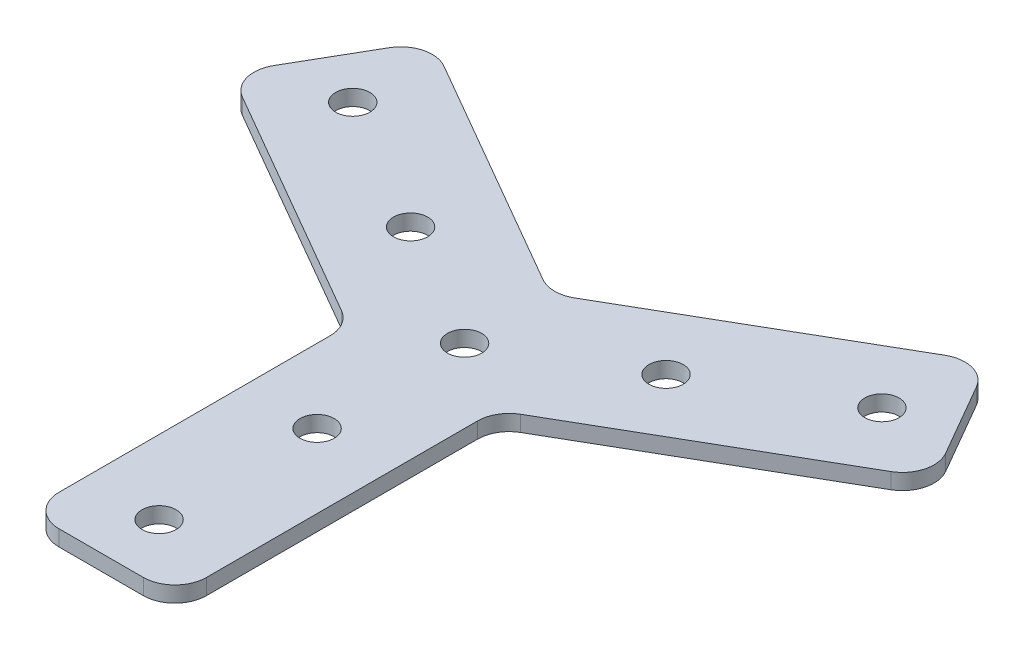
ISO-10303-21;
HEADER;
FILE_DESCRIPTION(('STEP AP214'),'2;1');
FILE_NAME('part.step','',(''),(''),'','','');
FILE_SCHEMA(('AUTOMOTIVE_DESIGN { 1 0 10303 214 1 1 1 1 }'));
ENDSEC;
DATA;
#1=APPLICATION_CONTEXT('core data for automotive mechanical design processes');
#2=APPLICATION_PROTOCOL_DEFINITION('international standard','automotive_design',2000,#1);
#3=PRODUCT_CONTEXT('',#1,'mechanical');
#4=PRODUCT('Part','Part','',(#3));
#5=PRODUCT_RELATED_PRODUCT_CATEGORY('part','',(#4));
#6=PRODUCT_DEFINITION_FORMATION('','',#4);
#7=PRODUCT_DEFINITION_CONTEXT('part definition',#1,'design');
#8=PRODUCT_DEFINITION('design','',#6,#7);
#9=PRODUCT_DEFINITION_SHAPE('','',#8);
#10=(LENGTH_UNIT() NAMED_UNIT(*) SI_UNIT(.MILLI.,.METRE.));
#11=(NAMED_UNIT(*) PLANE_ANGLE_UNIT() SI_UNIT($,.RADIAN.));
#12=(NAMED_UNIT(*) SI_UNIT($,.STERADIAN.) SOLID_ANGLE_UNIT());
#13=UNCERTAINTY_MEASURE_WITH_UNIT(LENGTH_MEASURE(1.E-05),#10,'distance_accuracy_value','');
#14=(GEOMETRIC_REPRESENTATION_CONTEXT(3) GLOBAL_UNCERTAINTY_ASSIGNED_CONTEXT((#13)) GLOBAL_UNIT_ASSIGNED_CONTEXT((#10,
#11,#12)) REPRESENTATION_CONTEXT('',''));
#15=CARTESIAN_POINT('',(0.,0.,0.));
#16=DIRECTION('',(0.,0.,1.));
#17=DIRECTION('',(1.,0.,0.));
#18=AXIS2_PLACEMENT_3D('',#15,#16,#17);
#19=CARTESIAN_POINT('',(-1.12860705479806,2.80807034313921,-7.07207801403957));
#20=DIRECTION('',(0.,-1.,0.));
#21=DIRECTION('',(0.,0.,-1.));
#22=AXIS2_PLACEMENT_3D('',#19,#20,#21);
#23=PLANE('',#22);
#24=CARTESIAN_POINT('',(10.9957485981869,2.80807034313921,-14.0720780140347));
#25=DIRECTION('',(0.,1.,0.));
#26=DIRECTION('',(0.,0.,1.));
#27=AXIS2_PLACEMENT_3D('',#24,#25,#26);
#28=CIRCLE('',#27,1.625);
#29=CARTESIAN_POINT('',(10.9957485981869,2.80807034313921,-12.4470780140347));
#30=VERTEX_POINT('',#29);
#31=EDGE_CURVE('E173',#30,#30,#28,.T.);
#32=ORIENTED_EDGE('',*,*,#31,.F.);
#33=EDGE_LOOP('',(#32));
#34=FACE_BOUND('',#33,.T.);
#35=CARTESIAN_POINT('',(23.9861296549535,2.80807034313921,-21.5720780140347));
#36=DIRECTION('',(0.,1.,0.));
#37=DIRECTION('',(0.,0.,1.));
#38=AXIS2_PLACEMENT_3D('',#35,#36,#37);
#39=CIRCLE('',#38,1.625);
#40=CARTESIAN_POINT('',(23.9861296549535,2.80807034313921,-19.9470780140347));
#41=VERTEX_POINT('',#40);
#42=EDGE_CURVE('E323',#41,#41,#39,.T.);
#43=ORIENTED_EDGE('',*,*,#42,.F.);
#44=EDGE_LOOP('',(#43));
#45=FACE_BOUND('',#44,.T.);
#46=CARTESIAN_POINT('',(-1.12860705480375,2.80807034313921,6.92792198596045));
#47=DIRECTION('',(0.,1.,0.));
#48=DIRECTION('',(-0.866025403784436,0.,-0.500000000000004));
#49=AXIS2_PLACEMENT_3D('',#46,#47,#48);
#50=CIRCLE('',#49,1.625);
#51=CARTESIAN_POINT('',(-2.53589833595346,2.80807034313921,6.11542198596044));
#52=VERTEX_POINT('',#51);
#53=EDGE_CURVE('E317',#52,#52,#50,.T.);
#54=ORIENTED_EDGE('',*,*,#53,.F.);
#55=EDGE_LOOP('',(#54));
#56=FACE_BOUND('',#55,.T.);
#57=CARTESIAN_POINT('',(-1.12860705480382,2.80807034313921,21.9279219859604));
#58=DIRECTION('',(0.,1.,0.));
#59=DIRECTION('',(-0.866025403784436,0.,-0.500000000000004));
#60=AXIS2_PLACEMENT_3D('',#57,#58,#59);
#61=CIRCLE('',#60,1.625);
#62=CARTESIAN_POINT('',(-2.53589833595353,2.80807034313921,21.1154219859604));
#63=VERTEX_POINT('',#62);
#64=EDGE_CURVE('E311',#63,#63,#61,.T.);
#65=ORIENTED_EDGE('',*,*,#64,.F.);
#66=EDGE_LOOP('',(#65));
#67=FACE_BOUND('',#66,.T.);
#68=CARTESIAN_POINT('',(-13.2529627077773,2.80807034313921,-14.0720780140446));
#69=DIRECTION('',(0.,1.,0.));
#70=DIRECTION('',(0.866025403784443,0.,-0.499999999999992));
#71=AXIS2_PLACEMENT_3D('',#68,#69,#70);
#72=CIRCLE('',#71,1.625);
#73=CARTESIAN_POINT('',(-11.8456714266276,2.80807034313921,-14.8845780140445));
#74=VERTEX_POINT('',#73);
#75=EDGE_CURVE('E305',#74,#74,#72,.T.);
#76=ORIENTED_EDGE('',*,*,#75,.F.);
#77=EDGE_LOOP('',(#76));
#78=FACE_BOUND('',#77,.T.);
#79=CARTESIAN_POINT('',(-26.2433437645438,2.80807034313921,-21.5720780140447));
#80=DIRECTION('',(0.,1.,0.));
#81=DIRECTION('',(0.866025403784443,0.,-0.499999999999992));
#82=AXIS2_PLACEMENT_3D('',#79,#80,#81);
#83=CIRCLE('',#82,1.625);
#84=CARTESIAN_POINT('',(-24.8360524833941,2.80807034313921,-22.3845780140447));
#85=VERTEX_POINT('',#84);
#86=EDGE_CURVE('E299',#85,#85,#83,.T.);
#87=ORIENTED_EDGE('',*,*,#86,.F.);
#88=EDGE_LOOP('',(#87));
#89=FACE_BOUND('',#88,.T.);
#90=CARTESIAN_POINT('',(-1.12860705479806,2.80807034313921,-7.07207801403957));
#91=DIRECTION('',(0.,1.,0.));
#92=DIRECTION('',(0.,0.,1.));
#93=AXIS2_PLACEMENT_3D('',#90,#91,#92);
#94=CIRCLE('',#93,1.625);
#95=CARTESIAN_POINT('',(-1.12860705479806,2.80807034313921,-5.44707801403957));
#96=VERTEX_POINT('',#95);
#97=EDGE_CURVE('E279',#96,#96,#94,.T.);
#98=ORIENTED_EDGE('',*,*,#97,.F.);
#99=EDGE_LOOP('',(#98));
#100=FACE_BOUND('',#99,.T.);
#101=DIRECTION('',(0.866025403784438,0.,-0.5));
#102=VECTOR('',#101,1.);
#103=CARTESIAN_POINT('',(5.87139294520211,2.80807034313921,-3.0306261297057));
#104=LINE('',#103,#102);
#105=CARTESIAN_POINT('',(7.37139294520178,2.80807034313921,-3.89665153348995));
#106=VERTEX_POINT('',#105);
#107=CARTESIAN_POINT('',(29.6511931644146,2.80807034313921,-16.7599001875436));
#108=VERTEX_POINT('',#107);
#109=EDGE_CURVE('E280',#106,#108,#104,.T.);
#110=ORIENTED_EDGE('',*,*,#109,.T.);
#111=CARTESIAN_POINT('',(28.1511931644146,2.80807034313921,-19.3579763988969));
#112=DIRECTION('',(0.,-1.,0.));
#113=DIRECTION('',(0.,0.,-1.));
#114=AXIS2_PLACEMENT_3D('',#111,#112,#113);
#115=CIRCLE('',#114,3.);
#116=CARTESIAN_POINT('',(30.7492693757679,2.80807034313921,-20.8579763988969));
#117=VERTEX_POINT('',#116);
#118=EDGE_CURVE('E187',#108,#117,#115,.F.);
#119=ORIENTED_EDGE('',*,*,#118,.T.);
#120=DIRECTION('',(-0.5,0.,-0.866025403784438));
#121=VECTOR('',#120,1.);
#122=CARTESIAN_POINT('',(32.2492693757679,2.80807034313921,-18.2599001875436));
#123=LINE('',#122,#121);
#124=CARTESIAN_POINT('',(26.7492693757679,2.80807034313921,-27.7861796291724));
#125=VERTEX_POINT('',#124);
#126=EDGE_CURVE('E282',#117,#125,#123,.T.);
#127=ORIENTED_EDGE('',*,*,#126,.T.);
#128=CARTESIAN_POINT('',(24.1511931644146,2.80807034313921,-26.2861796291725));
#129=DIRECTION('',(0.,-1.,0.));
#130=DIRECTION('',(0.,0.,-1.));
#131=AXIS2_PLACEMENT_3D('',#128,#129,#130);
#132=CIRCLE('',#131,3.);
#133=CARTESIAN_POINT('',(22.6511931644146,2.80807034313921,-28.8842558405258));
#134=VERTEX_POINT('',#133);
#135=EDGE_CURVE('E185',#125,#134,#132,.F.);
#136=ORIENTED_EDGE('',*,*,#135,.T.);
#137=DIRECTION('',(-0.866025403784438,0.,0.500000000000001));
#138=VECTOR('',#137,1.);
#139=CARTESIAN_POINT('',(25.2492693757679,2.80807034313921,-30.3842558405258));
#140=LINE('',#139,#138);
#141=CARTESIAN_POINT('',(0.371392945202446,2.80807034313921,-16.0210071864725));
#142=VERTEX_POINT('',#141);
#143=EDGE_CURVE('E285',#134,#142,#140,.T.);
#144=ORIENTED_EDGE('',*,*,#143,.T.);
#145=CARTESIAN_POINT('',(-1.12860705479756,2.80807034313921,-18.6190833978258));
#146=DIRECTION('',(0.,-1.,0.));
#147=DIRECTION('',(0.,0.,-1.));
#148=AXIS2_PLACEMENT_3D('',#145,#146,#147);
#149=CIRCLE('',#148,3.);
#150=CARTESIAN_POINT('',(-2.62860705479855,2.80807034313921,-16.0210071864731));
#151=VERTEX_POINT('',#150);
#152=EDGE_CURVE('E237',#142,#151,#149,.T.);
#153=ORIENTED_EDGE('',*,*,#152,.T.);
#154=DIRECTION('',(-0.866025403784248,0.,-0.500000000000331));
#155=VECTOR('',#154,1.);
#156=CARTESIAN_POINT('',(-1.12860705479821,2.80807034313921,-15.1549817826877));
#157=LINE('',#156,#155);
#158=CARTESIAN_POINT('',(-24.9084072740045,2.80807034313921,-28.8842558405341));
#159=VERTEX_POINT('',#158);
#160=EDGE_CURVE('E288',#151,#159,#157,.T.);
#161=ORIENTED_EDGE('',*,*,#160,.T.);
#162=CARTESIAN_POINT('',(-26.4084072740055,2.80807034313921,-26.2861796291814));
#163=DIRECTION('',(0.,-1.,0.));
#164=DIRECTION('',(0.,0.,-1.));
#165=AXIS2_PLACEMENT_3D('',#162,#163,#164);
#166=CIRCLE('',#165,3.);
#167=CARTESIAN_POINT('',(-29.0064834853588,2.80807034313921,-27.7861796291814));
#168=VERTEX_POINT('',#167);
#169=EDGE_CURVE('E183',#159,#168,#166,.F.);
#170=ORIENTED_EDGE('',*,*,#169,.T.);
#171=DIRECTION('',(-0.500000000000008,0.,0.866025403784434));
#172=VECTOR('',#171,1.);
#173=CARTESIAN_POINT('',(-27.5064834853582,2.80807034313921,-30.3842558405357));
#174=LINE('',#173,#172);
#175=CARTESIAN_POINT('',(-33.0064834853586,2.80807034313921,-20.8579763989064));
#176=VERTEX_POINT('',#175);
#177=EDGE_CURVE('E291',#168,#176,#174,.T.);
#178=ORIENTED_EDGE('',*,*,#177,.T.);
#179=CARTESIAN_POINT('',(-30.4084072740053,2.80807034313921,-19.3579763989064));
#180=DIRECTION('',(0.,-1.,0.));
#181=DIRECTION('',(0.,0.,-1.));
#182=AXIS2_PLACEMENT_3D('',#179,#180,#181);
#183=CIRCLE('',#182,3.);
#184=CARTESIAN_POINT('',(-31.9084072740058,2.80807034313921,-16.7599001875534));
#185=VERTEX_POINT('',#184);
#186=EDGE_CURVE('E153',#176,#185,#183,.F.);
#187=ORIENTED_EDGE('',*,*,#186,.T.);
#188=DIRECTION('',(0.86602540378434,0.,0.500000000000171));
#189=VECTOR('',#188,1.);
#190=CARTESIAN_POINT('',(-34.5064834853583,2.80807034313921,-18.2599001875536));
#191=LINE('',#190,#189);
#192=CARTESIAN_POINT('',(-9.62860705480327,2.80807034313921,-3.89665153349986));
#193=VERTEX_POINT('',#192);
#194=EDGE_CURVE('E244',#185,#193,#191,.T.);
#195=ORIENTED_EDGE('',*,*,#194,.T.);
#196=CARTESIAN_POINT('',(-11.1286070548038,2.80807034313921,-1.29857532214684));
#197=DIRECTION('',(0.,-1.,0.));
#198=DIRECTION('',(0.,0.,-1.));
#199=AXIS2_PLACEMENT_3D('',#196,#197,#198);
#200=CIRCLE('',#199,3.);
#201=CARTESIAN_POINT('',(-8.12860705480379,2.80807034313921,-1.29857532214682));
#202=VERTEX_POINT('',#201);
#203=EDGE_CURVE('E24',#193,#202,#200,.T.);
#204=ORIENTED_EDGE('',*,*,#203,.T.);
#205=DIRECTION('',(0.,0.,1.));
#206=VECTOR('',#205,1.);
#207=CARTESIAN_POINT('',(-8.12860705480378,2.80807034313921,-3.03062612971531));
#208=LINE('',#207,#206);
#209=CARTESIAN_POINT('',(-8.12860705480389,2.80807034313921,24.4279219859604));
#210=VERTEX_POINT('',#209);
#211=EDGE_CURVE('E242',#202,#210,#208,.T.);
#212=ORIENTED_EDGE('',*,*,#211,.T.);
#213=CARTESIAN_POINT('',(-5.12860705480389,2.80807034313921,24.4279219859604));
#214=DIRECTION('',(0.,-1.,0.));
#215=DIRECTION('',(0.,0.,-1.));
#216=AXIS2_PLACEMENT_3D('',#213,#214,#215);
#217=CIRCLE('',#216,3.);
#218=CARTESIAN_POINT('',(-5.12860705480391,2.80807034313921,27.4279219859604));
#219=VERTEX_POINT('',#218);
#220=EDGE_CURVE('E152',#210,#219,#217,.F.);
#221=ORIENTED_EDGE('',*,*,#220,.T.);
#222=DIRECTION('',(1.,0.,0.));
#223=VECTOR('',#222,1.);
#224=CARTESIAN_POINT('',(-8.12860705480391,2.80807034313921,27.4279219859604));
#225=LINE('',#224,#223);
#226=CARTESIAN_POINT('',(2.8713929451968,2.80807034313921,27.4279219859605));
#227=VERTEX_POINT('',#226);
#228=EDGE_CURVE('E147',#219,#227,#225,.T.);
#229=ORIENTED_EDGE('',*,*,#228,.T.);
#230=CARTESIAN_POINT('',(2.87139294519682,2.80807034313921,24.4279219859605));
#231=DIRECTION('',(0.,-1.,0.));
#232=DIRECTION('',(0.,0.,-1.));
#233=AXIS2_PLACEMENT_3D('',#230,#231,#232);
#234=CIRCLE('',#233,3.);
#235=CARTESIAN_POINT('',(5.87139294519682,2.80807034313921,24.427921985961));
#236=VERTEX_POINT('',#235);
#237=EDGE_CURVE('E142',#227,#236,#234,.F.);
#238=ORIENTED_EDGE('',*,*,#237,.T.);
#239=DIRECTION('',(1.92816358337802E-13,0.,-1.));
#240=VECTOR('',#239,1.);
#241=CARTESIAN_POINT('',(5.87139294519624,2.80807034313921,27.4279219859605));
#242=LINE('',#241,#240);
#243=CARTESIAN_POINT('',(5.87139294520178,2.80807034313921,-1.29857532213721));
#244=VERTEX_POINT('',#243);
#245=EDGE_CURVE('E145',#236,#244,#242,.T.);
#246=ORIENTED_EDGE('',*,*,#245,.T.);
#247=CARTESIAN_POINT('',(8.87139294520178,2.80807034313921,-1.29857532213663));
#248=DIRECTION('',(0.,-1.,0.));
#249=DIRECTION('',(0.,0.,-1.));
#250=AXIS2_PLACEMENT_3D('',#247,#248,#249);
#251=CIRCLE('',#250,3.);
#252=EDGE_CURVE('E233',#244,#106,#251,.T.);
#253=ORIENTED_EDGE('',*,*,#252,.T.);
#254=EDGE_LOOP('',(#110,#119,#127,#136,#144,#153,#161,#170,#178,#187,#195,#204,#212,#221,#229,
#238,#246,#253));
#255=FACE_BOUND('',#254,.T.);
#256=ADVANCED_FACE('F16',(#34,#45,#56,#67,#78,#89,#100,#255),#23,.F.);
#257=CARTESIAN_POINT('',(-1.12860705479806,1.30807034313921,-7.07207801403957));
#258=DIRECTION('',(0.,-1.,0.));
#259=DIRECTION('',(0.,0.,-1.));
#260=AXIS2_PLACEMENT_3D('',#257,#258,#259);
#261=PLANE('',#260);
#262=CARTESIAN_POINT('',(10.9957485981869,1.30807034313921,-14.0720780140347));
#263=DIRECTION('',(0.,1.,0.));
#264=DIRECTION('',(0.,0.,1.));
#265=AXIS2_PLACEMENT_3D('',#262,#263,#264);
#266=CIRCLE('',#265,1.625);
#267=CARTESIAN_POINT('',(10.9957485981869,1.30807034313921,-12.4470780140347));
#268=VERTEX_POINT('',#267);
#269=EDGE_CURVE('E168',#268,#268,#266,.T.);
#270=ORIENTED_EDGE('',*,*,#269,.T.);
#271=EDGE_LOOP('',(#270));
#272=FACE_BOUND('',#271,.T.);
#273=CARTESIAN_POINT('',(23.9861296549535,1.30807034313921,-21.5720780140347));
#274=DIRECTION('',(0.,1.,0.));
#275=DIRECTION('',(0.,0.,1.));
#276=AXIS2_PLACEMENT_3D('',#273,#274,#275);
#277=CIRCLE('',#276,1.625);
#278=CARTESIAN_POINT('',(23.9861296549535,1.30807034313921,-19.9470780140347));
#279=VERTEX_POINT('',#278);
#280=EDGE_CURVE('E326',#279,#279,#277,.T.);
#281=ORIENTED_EDGE('',*,*,#280,.T.);
#282=EDGE_LOOP('',(#281));
#283=FACE_BOUND('',#282,.T.);
#284=CARTESIAN_POINT('',(-1.12860705480375,1.30807034313921,6.92792198596045));
#285=DIRECTION('',(0.,1.,0.));
#286=DIRECTION('',(-0.866025403784436,0.,-0.500000000000004));
#287=AXIS2_PLACEMENT_3D('',#284,#285,#286);
#288=CIRCLE('',#287,1.625);
#289=CARTESIAN_POINT('',(-2.53589833595346,1.30807034313921,6.11542198596044));
#290=VERTEX_POINT('',#289);
#291=EDGE_CURVE('E320',#290,#290,#288,.T.);
#292=ORIENTED_EDGE('',*,*,#291,.T.);
#293=EDGE_LOOP('',(#292));
#294=FACE_BOUND('',#293,.T.);
#295=CARTESIAN_POINT('',(-1.12860705480382,1.30807034313921,21.9279219859604));
#296=DIRECTION('',(0.,1.,0.));
#297=DIRECTION('',(-0.866025403784436,0.,-0.500000000000004));
#298=AXIS2_PLACEMENT_3D('',#295,#296,#297);
#299=CIRCLE('',#298,1.625);
#300=CARTESIAN_POINT('',(-2.53589833595353,1.30807034313921,21.1154219859604));
#301=VERTEX_POINT('',#300);
#302=EDGE_CURVE('E314',#301,#301,#299,.T.);
#303=ORIENTED_EDGE('',*,*,#302,.T.);
#304=EDGE_LOOP('',(#303));
#305=FACE_BOUND('',#304,.T.);
#306=CARTESIAN_POINT('',(-13.2529627077773,1.30807034313921,-14.0720780140446));
#307=DIRECTION('',(0.,1.,0.));
#308=DIRECTION('',(0.866025403784443,0.,-0.499999999999992));
#309=AXIS2_PLACEMENT_3D('',#306,#307,#308);
#310=CIRCLE('',#309,1.625);
#311=CARTESIAN_POINT('',(-11.8456714266276,1.30807034313921,-14.8845780140445));
#312=VERTEX_POINT('',#311);
#313=EDGE_CURVE('E308',#312,#312,#310,.T.);
#314=ORIENTED_EDGE('',*,*,#313,.T.);
#315=EDGE_LOOP('',(#314));
#316=FACE_BOUND('',#315,.T.);
#317=CARTESIAN_POINT('',(-26.2433437645438,1.30807034313921,-21.5720780140447));
#318=DIRECTION('',(0.,1.,0.));
#319=DIRECTION('',(0.866025403784443,0.,-0.499999999999992));
#320=AXIS2_PLACEMENT_3D('',#317,#318,#319);
#321=CIRCLE('',#320,1.625);
#322=CARTESIAN_POINT('',(-24.8360524833941,1.30807034313921,-22.3845780140447));
#323=VERTEX_POINT('',#322);
#324=EDGE_CURVE('E302',#323,#323,#321,.T.);
#325=ORIENTED_EDGE('',*,*,#324,.T.);
#326=EDGE_LOOP('',(#325));
#327=FACE_BOUND('',#326,.T.);
#328=CARTESIAN_POINT('',(-1.12860705479806,1.30807034313921,-7.07207801403957));
#329=DIRECTION('',(0.,1.,0.));
#330=DIRECTION('',(0.,0.,1.));
#331=AXIS2_PLACEMENT_3D('',#328,#329,#330);
#332=CIRCLE('',#331,1.625);
#333=CARTESIAN_POINT('',(-1.12860705479806,1.30807034313921,-5.44707801403957));
#334=VERTEX_POINT('',#333);
#335=EDGE_CURVE('E296',#334,#334,#332,.T.);
#336=ORIENTED_EDGE('',*,*,#335,.T.);
#337=EDGE_LOOP('',(#336));
#338=FACE_BOUND('',#337,.T.);
#339=DIRECTION('',(-0.5,0.,-0.866025403784438));
#340=VECTOR('',#339,1.);
#341=CARTESIAN_POINT('',(32.2492693757679,1.30807034313921,-18.2599001875436));
#342=LINE('',#341,#340);
#343=CARTESIAN_POINT('',(30.7492693757679,1.30807034313921,-20.8579763988969));
#344=VERTEX_POINT('',#343);
#345=CARTESIAN_POINT('',(26.7492693757679,1.30807034313921,-27.7861796291724));
#346=VERTEX_POINT('',#345);
#347=EDGE_CURVE('E435',#344,#346,#342,.T.);
#348=ORIENTED_EDGE('',*,*,#347,.F.);
#349=CARTESIAN_POINT('',(28.1511931644146,1.30807034313921,-19.3579763988969));
#350=DIRECTION('',(0.,-1.,0.));
#351=DIRECTION('',(0.,0.,-1.));
#352=AXIS2_PLACEMENT_3D('',#349,#350,#351);
#353=CIRCLE('',#352,3.);
#354=CARTESIAN_POINT('',(29.6511931644146,1.30807034313921,-16.7599001875436));
#355=VERTEX_POINT('',#354);
#356=EDGE_CURVE('E203',#344,#355,#353,.T.);
#357=ORIENTED_EDGE('',*,*,#356,.T.);
#358=DIRECTION('',(0.866025403784438,0.,-0.5));
#359=VECTOR('',#358,1.);
#360=CARTESIAN_POINT('',(5.87139294520211,1.30807034313921,-3.0306261297057));
#361=LINE('',#360,#359);
#362=CARTESIAN_POINT('',(7.37139294520178,1.30807034313921,-3.89665153348995));
#363=VERTEX_POINT('',#362);
#364=EDGE_CURVE('E163',#363,#355,#361,.T.);
#365=ORIENTED_EDGE('',*,*,#364,.F.);
#366=CARTESIAN_POINT('',(8.87139294520178,1.30807034313921,-1.29857532213663));
#367=DIRECTION('',(0.,-1.,0.));
#368=DIRECTION('',(0.,0.,-1.));
#369=AXIS2_PLACEMENT_3D('',#366,#367,#368);
#370=CIRCLE('',#369,3.);
#371=CARTESIAN_POINT('',(5.87139294520178,1.30807034313921,-1.29857532213721));
#372=VERTEX_POINT('',#371);
#373=EDGE_CURVE('E235',#363,#372,#370,.F.);
#374=ORIENTED_EDGE('',*,*,#373,.T.);
#375=DIRECTION('',(1.92816358337802E-13,0.,-1.));
#376=VECTOR('',#375,1.);
#377=CARTESIAN_POINT('',(5.87139294519624,1.30807034313921,27.4279219859605));
#378=LINE('',#377,#376);
#379=CARTESIAN_POINT('',(5.87139294519682,1.30807034313921,24.427921985961));
#380=VERTEX_POINT('',#379);
#381=EDGE_CURVE('E277',#380,#372,#378,.T.);
#382=ORIENTED_EDGE('',*,*,#381,.F.);
#383=CARTESIAN_POINT('',(2.87139294519682,1.30807034313921,24.4279219859605));
#384=DIRECTION('',(0.,-1.,0.));
#385=DIRECTION('',(0.,0.,-1.));
#386=AXIS2_PLACEMENT_3D('',#383,#384,#385);
#387=CIRCLE('',#386,3.);
#388=CARTESIAN_POINT('',(2.8713929451968,1.30807034313921,27.4279219859605));
#389=VERTEX_POINT('',#388);
#390=EDGE_CURVE('E167',#380,#389,#387,.T.);
#391=ORIENTED_EDGE('',*,*,#390,.T.);
#392=DIRECTION('',(1.,0.,0.));
#393=VECTOR('',#392,1.);
#394=CARTESIAN_POINT('',(-8.12860705480391,1.30807034313921,27.4279219859604));
#395=LINE('',#394,#393);
#396=CARTESIAN_POINT('',(-5.12860705480391,1.30807034313921,27.4279219859604));
#397=VERTEX_POINT('',#396);
#398=EDGE_CURVE('E268',#397,#389,#395,.T.);
#399=ORIENTED_EDGE('',*,*,#398,.F.);
#400=CARTESIAN_POINT('',(-5.12860705480389,1.30807034313921,24.4279219859604));
#401=DIRECTION('',(0.,-1.,0.));
#402=DIRECTION('',(0.,0.,-1.));
#403=AXIS2_PLACEMENT_3D('',#400,#401,#402);
#404=CIRCLE('',#403,3.);
#405=CARTESIAN_POINT('',(-8.12860705480389,1.30807034313921,24.4279219859604));
#406=VERTEX_POINT('',#405);
#407=EDGE_CURVE('E197',#397,#406,#404,.T.);
#408=ORIENTED_EDGE('',*,*,#407,.T.);
#409=DIRECTION('',(0.,0.,1.));
#410=VECTOR('',#409,1.);
#411=CARTESIAN_POINT('',(-8.12860705480378,1.30807034313921,-3.03062612971531));
#412=LINE('',#411,#410);
#413=CARTESIAN_POINT('',(-8.12860705480379,1.30807034313921,-1.29857532214682));
#414=VERTEX_POINT('',#413);
#415=EDGE_CURVE('E262',#414,#406,#412,.T.);
#416=ORIENTED_EDGE('',*,*,#415,.F.);
#417=CARTESIAN_POINT('',(-11.1286070548038,1.30807034313921,-1.29857532214684));
#418=DIRECTION('',(0.,-1.,0.));
#419=DIRECTION('',(0.,0.,-1.));
#420=AXIS2_PLACEMENT_3D('',#417,#418,#419);
#421=CIRCLE('',#420,3.);
#422=CARTESIAN_POINT('',(-9.62860705480327,1.30807034313921,-3.89665153349986));
#423=VERTEX_POINT('',#422);
#424=EDGE_CURVE('E10',#414,#423,#421,.F.);
#425=ORIENTED_EDGE('',*,*,#424,.T.);
#426=DIRECTION('',(0.86602540378434,0.,0.500000000000171));
#427=VECTOR('',#426,1.);
#428=CARTESIAN_POINT('',(-34.5064834853583,1.30807034313921,-18.2599001875536));
#429=LINE('',#428,#427);
#430=CARTESIAN_POINT('',(-31.9084072740058,1.30807034313921,-16.7599001875534));
#431=VERTEX_POINT('',#430);
#432=EDGE_CURVE('E260',#431,#423,#429,.T.);
#433=ORIENTED_EDGE('',*,*,#432,.F.);
#434=CARTESIAN_POINT('',(-30.4084072740053,1.30807034313921,-19.3579763989064));
#435=DIRECTION('',(0.,-1.,0.));
#436=DIRECTION('',(0.,0.,-1.));
#437=AXIS2_PLACEMENT_3D('',#434,#435,#436);
#438=CIRCLE('',#437,3.);
#439=CARTESIAN_POINT('',(-33.0064834853586,1.30807034313921,-20.8579763989064));
#440=VERTEX_POINT('',#439);
#441=EDGE_CURVE('E194',#431,#440,#438,.T.);
#442=ORIENTED_EDGE('',*,*,#441,.T.);
#443=DIRECTION('',(-0.500000000000008,0.,0.866025403784434));
#444=VECTOR('',#443,1.);
#445=CARTESIAN_POINT('',(-27.5064834853582,1.30807034313921,-30.3842558405357));
#446=LINE('',#445,#444);
#447=CARTESIAN_POINT('',(-29.0064834853588,1.30807034313921,-27.7861796291814));
#448=VERTEX_POINT('',#447);
#449=EDGE_CURVE('E266',#448,#440,#446,.T.);
#450=ORIENTED_EDGE('',*,*,#449,.F.);
#451=CARTESIAN_POINT('',(-26.4084072740055,1.30807034313921,-26.2861796291814));
#452=DIRECTION('',(0.,-1.,0.));
#453=DIRECTION('',(0.,0.,-1.));
#454=AXIS2_PLACEMENT_3D('',#451,#452,#453);
#455=CIRCLE('',#454,3.);
#456=CARTESIAN_POINT('',(-24.9084072740045,1.30807034313921,-28.8842558405341));
#457=VERTEX_POINT('',#456);
#458=EDGE_CURVE('E199',#448,#457,#455,.T.);
#459=ORIENTED_EDGE('',*,*,#458,.T.);
#460=DIRECTION('',(-0.866025403784248,0.,-0.500000000000331));
#461=VECTOR('',#460,1.);
#462=CARTESIAN_POINT('',(-1.12860705479821,1.30807034313921,-15.1549817826877));
#463=LINE('',#462,#461);
#464=CARTESIAN_POINT('',(-2.62860705479855,1.30807034313921,-16.0210071864731));
#465=VERTEX_POINT('',#464);
#466=EDGE_CURVE('E271',#465,#457,#463,.T.);
#467=ORIENTED_EDGE('',*,*,#466,.F.);
#468=CARTESIAN_POINT('',(-1.12860705479756,1.30807034313921,-18.6190833978258));
#469=DIRECTION('',(0.,-1.,0.));
#470=DIRECTION('',(0.,0.,-1.));
#471=AXIS2_PLACEMENT_3D('',#468,#469,#470);
#472=CIRCLE('',#471,3.);
#473=CARTESIAN_POINT('',(0.371392945202446,1.30807034313921,-16.0210071864725));
#474=VERTEX_POINT('',#473);
#475=EDGE_CURVE('E31',#465,#474,#472,.F.);
#476=ORIENTED_EDGE('',*,*,#475,.T.);
#477=DIRECTION('',(-0.866025403784438,0.,0.500000000000001));
#478=VECTOR('',#477,1.);
#479=CARTESIAN_POINT('',(25.2492693757679,1.30807034313921,-30.3842558405258));
#480=LINE('',#479,#478);
#481=CARTESIAN_POINT('',(22.6511931644146,1.30807034313921,-28.8842558405258));
#482=VERTEX_POINT('',#481);
#483=EDGE_CURVE('E434',#482,#474,#480,.T.);
#484=ORIENTED_EDGE('',*,*,#483,.F.);
#485=CARTESIAN_POINT('',(24.1511931644146,1.30807034313921,-26.2861796291725));
#486=DIRECTION('',(0.,-1.,0.));
#487=DIRECTION('',(0.,0.,-1.));
#488=AXIS2_PLACEMENT_3D('',#485,#486,#487);
#489=CIRCLE('',#488,3.);
#490=EDGE_CURVE('E201',#482,#346,#489,.T.);
#491=ORIENTED_EDGE('',*,*,#490,.T.);
#492=EDGE_LOOP('',(#348,#357,#365,#374,#382,#391,#399,#408,#416,#425,#433,#442,#450,#459,#467,
#476,#484,#491));
#493=FACE_BOUND('',#492,.T.);
#494=ADVANCED_FACE('F259',(#272,#283,#294,#305,#316,#327,#338,#493),#261,.T.);
#495=CARTESIAN_POINT('',(10.9957485981869,1.30807034313921,-14.0720780140347));
#496=DIRECTION('',(0.,1.,0.));
#497=DIRECTION('',(0.,0.,1.));
#498=AXIS2_PLACEMENT_3D('',#495,#496,#497);
#499=CYLINDRICAL_SURFACE('',#498,1.625);
#500=ORIENTED_EDGE('',*,*,#269,.F.);
#501=EDGE_LOOP('',(#500));
#502=FACE_BOUND('',#501,.T.);
#503=ORIENTED_EDGE('',*,*,#31,.T.);
#504=EDGE_LOOP('',(#503));
#505=FACE_BOUND('',#504,.T.);
#506=ADVANCED_FACE('F380',(#502,#505),#499,.F.);
#507=CARTESIAN_POINT('',(23.9861296549535,1.30807034313921,-21.5720780140347));
#508=DIRECTION('',(0.,1.,0.));
#509=DIRECTION('',(0.,0.,1.));
#510=AXIS2_PLACEMENT_3D('',#507,#508,#509);
#511=CYLINDRICAL_SURFACE('',#510,1.625);
#512=ORIENTED_EDGE('',*,*,#280,.F.);
#513=EDGE_LOOP('',(#512));
#514=FACE_BOUND('',#513,.T.);
#515=ORIENTED_EDGE('',*,*,#42,.T.);
#516=EDGE_LOOP('',(#515));
#517=FACE_BOUND('',#516,.T.);
#518=ADVANCED_FACE('F332',(#514,#517),#511,.F.);
#519=CARTESIAN_POINT('',(-1.12860705480375,1.30807034313921,6.92792198596045));
#520=DIRECTION('',(0.,1.,0.));
#521=DIRECTION('',(0.,0.,1.));
#522=AXIS2_PLACEMENT_3D('',#519,#520,#521);
#523=CYLINDRICAL_SURFACE('',#522,1.625);
#524=ORIENTED_EDGE('',*,*,#291,.F.);
#525=EDGE_LOOP('',(#524));
#526=FACE_BOUND('',#525,.T.);
#527=ORIENTED_EDGE('',*,*,#53,.T.);
#528=EDGE_LOOP('',(#527));
#529=FACE_BOUND('',#528,.T.);
#530=ADVANCED_FACE('F373',(#526,#529),#523,.F.);
#531=CARTESIAN_POINT('',(-1.12860705480382,1.30807034313921,21.9279219859604));
#532=DIRECTION('',(0.,1.,0.));
#533=DIRECTION('',(0.,0.,1.));
#534=AXIS2_PLACEMENT_3D('',#531,#532,#533);
#535=CYLINDRICAL_SURFACE('',#534,1.625);
#536=ORIENTED_EDGE('',*,*,#302,.F.);
#537=EDGE_LOOP('',(#536));
#538=FACE_BOUND('',#537,.T.);
#539=ORIENTED_EDGE('',*,*,#64,.T.);
#540=EDGE_LOOP('',(#539));
#541=FACE_BOUND('',#540,.T.);
#542=ADVANCED_FACE('F369',(#538,#541),#535,.F.);
#543=CARTESIAN_POINT('',(-13.2529627077773,1.30807034313921,-14.0720780140446));
#544=DIRECTION('',(0.,1.,0.));
#545=DIRECTION('',(0.,0.,1.));
#546=AXIS2_PLACEMENT_3D('',#543,#544,#545);
#547=CYLINDRICAL_SURFACE('',#546,1.625);
#548=ORIENTED_EDGE('',*,*,#313,.F.);
#549=EDGE_LOOP('',(#548));
#550=FACE_BOUND('',#549,.T.);
#551=ORIENTED_EDGE('',*,*,#75,.T.);
#552=EDGE_LOOP('',(#551));
#553=FACE_BOUND('',#552,.T.);
#554=ADVANCED_FACE('F361',(#550,#553),#547,.F.);
#555=CARTESIAN_POINT('',(-26.2433437645438,1.30807034313921,-21.5720780140447));
#556=DIRECTION('',(0.,1.,0.));
#557=DIRECTION('',(0.,0.,1.));
#558=AXIS2_PLACEMENT_3D('',#555,#556,#557);
#559=CYLINDRICAL_SURFACE('',#558,1.625);
#560=ORIENTED_EDGE('',*,*,#324,.F.);
#561=EDGE_LOOP('',(#560));
#562=FACE_BOUND('',#561,.T.);
#563=ORIENTED_EDGE('',*,*,#86,.T.);
#564=EDGE_LOOP('',(#563));
#565=FACE_BOUND('',#564,.T.);
#566=ADVANCED_FACE('F351',(#562,#565),#559,.F.);
#567=CARTESIAN_POINT('',(-1.12860705479806,1.30807034313921,-7.07207801403957));
#568=DIRECTION('',(0.,1.,0.));
#569=DIRECTION('',(0.,0.,1.));
#570=AXIS2_PLACEMENT_3D('',#567,#568,#569);
#571=CYLINDRICAL_SURFACE('',#570,1.625);
#572=ORIENTED_EDGE('',*,*,#335,.F.);
#573=EDGE_LOOP('',(#572));
#574=FACE_BOUND('',#573,.T.);
#575=ORIENTED_EDGE('',*,*,#97,.T.);
#576=EDGE_LOOP('',(#575));
#577=FACE_BOUND('',#576,.T.);
#578=ADVANCED_FACE('F348',(#574,#577),#571,.F.);
#579=CARTESIAN_POINT('',(5.87139294520211,1.30807034313921,-3.0306261297057));
#580=DIRECTION('',(0.500000000000001,0.,0.866025403784438));
#581=DIRECTION('',(0.866025403784438,0.,-0.500000000000001));
#582=AXIS2_PLACEMENT_3D('',#579,#580,#581);
#583=PLANE('',#582);
#584=ORIENTED_EDGE('',*,*,#109,.F.);
#585=DIRECTION('',(0.,1.,0.));
#586=VECTOR('',#585,1.);
#587=CARTESIAN_POINT('',(7.37139294520178,1.30807034313921,-3.89665153348995));
#588=LINE('',#587,#586);
#589=EDGE_CURVE('E179',#106,#363,#588,.F.);
#590=ORIENTED_EDGE('',*,*,#589,.T.);
#591=ORIENTED_EDGE('',*,*,#364,.T.);
#592=DIRECTION('',(0.,1.,0.));
#593=VECTOR('',#592,1.);
#594=CARTESIAN_POINT('',(29.6511931644146,1.30807034313921,-16.7599001875436));
#595=LINE('',#594,#593);
#596=EDGE_CURVE('E170',#355,#108,#595,.T.);
#597=ORIENTED_EDGE('',*,*,#596,.T.);
#598=EDGE_LOOP('',(#584,#590,#591,#597));
#599=FACE_BOUND('',#598,.T.);
#600=ADVANCED_FACE('F350',(#599),#583,.T.);
#601=CARTESIAN_POINT('',(5.87139294519624,1.30807034313921,27.4279219859605));
#602=DIRECTION('',(1.,0.,1.92816358337802E-13));
#603=DIRECTION('',(1.92816358337802E-13,0.,-1.));
#604=AXIS2_PLACEMENT_3D('',#601,#602,#603);
#605=PLANE('',#604);
#606=ORIENTED_EDGE('',*,*,#381,.T.);
#607=DIRECTION('',(0.,1.,0.));
#608=VECTOR('',#607,1.);
#609=CARTESIAN_POINT('',(5.87139294520178,2.80807034313921,-1.29857532213721));
#610=LINE('',#609,#608);
#611=EDGE_CURVE('E162',#372,#244,#610,.T.);
#612=ORIENTED_EDGE('',*,*,#611,.T.);
#613=ORIENTED_EDGE('',*,*,#245,.F.);
#614=DIRECTION('',(0.,1.,0.));
#615=VECTOR('',#614,1.);
#616=CARTESIAN_POINT('',(5.87139294519682,1.30807034313921,24.427921985961));
#617=LINE('',#616,#615);
#618=EDGE_CURVE('E159',#236,#380,#617,.F.);
#619=ORIENTED_EDGE('',*,*,#618,.T.);
#620=EDGE_LOOP('',(#606,#612,#613,#619));
#621=FACE_BOUND('',#620,.T.);
#622=ADVANCED_FACE('F158',(#621),#605,.T.);
#623=CARTESIAN_POINT('',(-8.12860705480391,1.30807034313921,27.4279219859604));
#624=DIRECTION('',(0.,0.,1.));
#625=DIRECTION('',(1.,0.,0.));
#626=AXIS2_PLACEMENT_3D('',#623,#624,#625);
#627=PLANE('',#626);
#628=ORIENTED_EDGE('',*,*,#228,.F.);
#629=DIRECTION('',(0.,1.,0.));
#630=VECTOR('',#629,1.);
#631=CARTESIAN_POINT('',(-5.12860705480391,1.30807034313921,27.4279219859604));
#632=LINE('',#631,#630);
#633=EDGE_CURVE('E231',#219,#397,#632,.F.);
#634=ORIENTED_EDGE('',*,*,#633,.T.);
#635=ORIENTED_EDGE('',*,*,#398,.T.);
#636=DIRECTION('',(0.,1.,0.));
#637=VECTOR('',#636,1.);
#638=CARTESIAN_POINT('',(2.8713929451968,1.30807034313921,27.4279219859605));
#639=LINE('',#638,#637);
#640=EDGE_CURVE('E229',#389,#227,#639,.T.);
#641=ORIENTED_EDGE('',*,*,#640,.T.);
#642=EDGE_LOOP('',(#628,#634,#635,#641));
#643=FACE_BOUND('',#642,.T.);
#644=ADVANCED_FACE('F468',(#643),#627,.T.);
#645=CARTESIAN_POINT('',(-8.12860705480378,1.30807034313921,-3.03062612971531));
#646=DIRECTION('',(-1.,0.,0.));
#647=DIRECTION('',(0.,0.,1.));
#648=AXIS2_PLACEMENT_3D('',#645,#646,#647);
#649=PLANE('',#648);
#650=ORIENTED_EDGE('',*,*,#211,.F.);
#651=DIRECTION('',(0.,1.,0.));
#652=VECTOR('',#651,1.);
#653=CARTESIAN_POINT('',(-8.12860705480379,1.30807034313921,-1.29857532214682));
#654=LINE('',#653,#652);
#655=EDGE_CURVE('E227',#202,#414,#654,.F.);
#656=ORIENTED_EDGE('',*,*,#655,.T.);
#657=ORIENTED_EDGE('',*,*,#415,.T.);
#658=DIRECTION('',(0.,1.,0.));
#659=VECTOR('',#658,1.);
#660=CARTESIAN_POINT('',(-8.12860705480389,1.30807034313921,24.4279219859604));
#661=LINE('',#660,#659);
#662=EDGE_CURVE('E224',#406,#210,#661,.T.);
#663=ORIENTED_EDGE('',*,*,#662,.T.);
#664=EDGE_LOOP('',(#650,#656,#657,#663));
#665=FACE_BOUND('',#664,.T.);
#666=ADVANCED_FACE('F249',(#665),#649,.T.);
#667=CARTESIAN_POINT('',(-34.5064834853583,1.30807034313921,-18.2599001875536));
#668=DIRECTION('',(-0.500000000000171,0.,0.86602540378434));
#669=DIRECTION('',(0.86602540378434,0.,0.500000000000171));
#670=AXIS2_PLACEMENT_3D('',#667,#668,#669);
#671=PLANE('',#670);
#672=ORIENTED_EDGE('',*,*,#432,.T.);
#673=DIRECTION('',(0.,1.,0.));
#674=VECTOR('',#673,1.);
#675=CARTESIAN_POINT('',(-9.62860705480328,2.80807034313921,-3.89665153349986));
#676=LINE('',#675,#674);
#677=EDGE_CURVE('E221',#423,#193,#676,.T.);
#678=ORIENTED_EDGE('',*,*,#677,.T.);
#679=ORIENTED_EDGE('',*,*,#194,.F.);
#680=DIRECTION('',(0.,1.,0.));
#681=VECTOR('',#680,1.);
#682=CARTESIAN_POINT('',(-31.9084072740058,1.30807034313921,-16.7599001875534));
#683=LINE('',#682,#681);
#684=EDGE_CURVE('E219',#185,#431,#683,.F.);
#685=ORIENTED_EDGE('',*,*,#684,.T.);
#686=EDGE_LOOP('',(#672,#678,#679,#685));
#687=FACE_BOUND('',#686,.T.);
#688=ADVANCED_FACE('F264',(#687),#671,.T.);
#689=CARTESIAN_POINT('',(-27.5064834853582,1.30807034313921,-30.3842558405357));
#690=DIRECTION('',(-0.866025403784434,0.,-0.500000000000008));
#691=DIRECTION('',(-0.500000000000008,0.,0.866025403784434));
#692=AXIS2_PLACEMENT_3D('',#689,#690,#691);
#693=PLANE('',#692);
#694=ORIENTED_EDGE('',*,*,#177,.F.);
#695=DIRECTION('',(0.,1.,0.));
#696=VECTOR('',#695,1.);
#697=CARTESIAN_POINT('',(-29.0064834853588,1.30807034313921,-27.7861796291814));
#698=LINE('',#697,#696);
#699=EDGE_CURVE('E217',#168,#448,#698,.F.);
#700=ORIENTED_EDGE('',*,*,#699,.T.);
#701=ORIENTED_EDGE('',*,*,#449,.T.);
#702=DIRECTION('',(0.,1.,0.));
#703=VECTOR('',#702,1.);
#704=CARTESIAN_POINT('',(-33.0064834853586,1.30807034313921,-20.8579763989064));
#705=LINE('',#704,#703);
#706=EDGE_CURVE('E214',#440,#176,#705,.T.);
#707=ORIENTED_EDGE('',*,*,#706,.T.);
#708=EDGE_LOOP('',(#694,#700,#701,#707));
#709=FACE_BOUND('',#708,.T.);
#710=ADVANCED_FACE('F426',(#709),#693,.T.);
#711=CARTESIAN_POINT('',(-1.12860705479821,1.30807034313921,-15.1549817826877));
#712=DIRECTION('',(0.500000000000331,0.,-0.866025403784247));
#713=DIRECTION('',(-0.866025403784248,0.,-0.500000000000331));
#714=AXIS2_PLACEMENT_3D('',#711,#712,#713);
#715=PLANE('',#714);
#716=ORIENTED_EDGE('',*,*,#160,.F.);
#717=DIRECTION('',(0.,1.,0.));
#718=VECTOR('',#717,1.);
#719=CARTESIAN_POINT('',(-2.62860705479855,1.30807034313921,-16.0210071864731));
#720=LINE('',#719,#718);
#721=EDGE_CURVE('E212',#151,#465,#720,.F.);
#722=ORIENTED_EDGE('',*,*,#721,.T.);
#723=ORIENTED_EDGE('',*,*,#466,.T.);
#724=DIRECTION('',(0.,1.,0.));
#725=VECTOR('',#724,1.);
#726=CARTESIAN_POINT('',(-24.9084072740045,1.30807034313921,-28.8842558405341));
#727=LINE('',#726,#725);
#728=EDGE_CURVE('E209',#457,#159,#727,.T.);
#729=ORIENTED_EDGE('',*,*,#728,.T.);
#730=EDGE_LOOP('',(#716,#722,#723,#729));
#731=FACE_BOUND('',#730,.T.);
#732=ADVANCED_FACE('F432',(#731),#715,.T.);
#733=CARTESIAN_POINT('',(25.2492693757679,1.30807034313921,-30.3842558405258));
#734=DIRECTION('',(-0.500000000000001,0.,-0.866025403784438));
#735=DIRECTION('',(-0.866025403784438,0.,0.500000000000001));
#736=AXIS2_PLACEMENT_3D('',#733,#734,#735);
#737=PLANE('',#736);
#738=ORIENTED_EDGE('',*,*,#143,.F.);
#739=DIRECTION('',(0.,1.,0.));
#740=VECTOR('',#739,1.);
#741=CARTESIAN_POINT('',(22.6511931644146,1.30807034313921,-28.8842558405258));
#742=LINE('',#741,#740);
#743=EDGE_CURVE('E38',#134,#482,#742,.F.);
#744=ORIENTED_EDGE('',*,*,#743,.T.);
#745=ORIENTED_EDGE('',*,*,#483,.T.);
#746=DIRECTION('',(0.,1.,0.));
#747=VECTOR('',#746,1.);
#748=CARTESIAN_POINT('',(0.371392945202447,2.80807034313921,-16.0210071864725));
#749=LINE('',#748,#747);
#750=EDGE_CURVE('E205',#474,#142,#749,.T.);
#751=ORIENTED_EDGE('',*,*,#750,.T.);
#752=EDGE_LOOP('',(#738,#744,#745,#751));
#753=FACE_BOUND('',#752,.T.);
#754=ADVANCED_FACE('F452',(#753),#737,.T.);
#755=CARTESIAN_POINT('',(32.2492693757679,1.30807034313921,-18.2599001875436));
#756=DIRECTION('',(0.866025403784439,0.,-0.5));
#757=DIRECTION('',(-0.5,0.,-0.866025403784439));
#758=AXIS2_PLACEMENT_3D('',#755,#756,#757);
#759=PLANE('',#758);
#760=ORIENTED_EDGE('',*,*,#126,.F.);
#761=DIRECTION('',(0.,1.,0.));
#762=VECTOR('',#761,1.);
#763=CARTESIAN_POINT('',(30.7492693757679,1.30807034313921,-20.8579763988969));
#764=LINE('',#763,#762);
#765=EDGE_CURVE('E192',#117,#344,#764,.F.);
#766=ORIENTED_EDGE('',*,*,#765,.T.);
#767=ORIENTED_EDGE('',*,*,#347,.T.);
#768=DIRECTION('',(0.,1.,0.));
#769=VECTOR('',#768,1.);
#770=CARTESIAN_POINT('',(26.7492693757679,1.30807034313921,-27.7861796291725));
#771=LINE('',#770,#769);
#772=EDGE_CURVE('E189',#346,#125,#771,.T.);
#773=ORIENTED_EDGE('',*,*,#772,.T.);
#774=EDGE_LOOP('',(#760,#766,#767,#773));
#775=FACE_BOUND('',#774,.T.);
#776=ADVANCED_FACE('F392',(#775),#759,.T.);
#777=CARTESIAN_POINT('',(8.87139294520178,1.30807034313921,-1.29857532213663));
#778=DIRECTION('',(0.,-1.,0.));
#779=DIRECTION('',(0.,0.,-1.));
#780=AXIS2_PLACEMENT_3D('',#777,#778,#779);
#781=CYLINDRICAL_SURFACE('',#780,3.);
#782=ORIENTED_EDGE('',*,*,#373,.F.);
#783=ORIENTED_EDGE('',*,*,#589,.F.);
#784=ORIENTED_EDGE('',*,*,#252,.F.);
#785=ORIENTED_EDGE('',*,*,#611,.F.);
#786=EDGE_LOOP('',(#782,#783,#784,#785));
#787=FACE_BOUND('',#786,.T.);
#788=ADVANCED_FACE('F388',(#787),#781,.F.);
#789=CARTESIAN_POINT('',(28.1511931644146,1.30807034313921,-19.3579763988969));
#790=DIRECTION('',(0.,1.,0.));
#791=DIRECTION('',(0.,0.,1.));
#792=AXIS2_PLACEMENT_3D('',#789,#790,#791);
#793=CYLINDRICAL_SURFACE('',#792,3.);
#794=ORIENTED_EDGE('',*,*,#356,.F.);
#795=ORIENTED_EDGE('',*,*,#765,.F.);
#796=ORIENTED_EDGE('',*,*,#118,.F.);
#797=ORIENTED_EDGE('',*,*,#596,.F.);
#798=EDGE_LOOP('',(#794,#795,#796,#797));
#799=FACE_BOUND('',#798,.T.);
#800=ADVANCED_FACE('F391',(#799),#793,.T.);
#801=CARTESIAN_POINT('',(24.1511931644146,1.30807034313921,-26.2861796291725));
#802=DIRECTION('',(0.,1.,0.));
#803=DIRECTION('',(0.,0.,1.));
#804=AXIS2_PLACEMENT_3D('',#801,#802,#803);
#805=CYLINDRICAL_SURFACE('',#804,3.);
#806=ORIENTED_EDGE('',*,*,#490,.F.);
#807=ORIENTED_EDGE('',*,*,#743,.F.);
#808=ORIENTED_EDGE('',*,*,#135,.F.);
#809=ORIENTED_EDGE('',*,*,#772,.F.);
#810=EDGE_LOOP('',(#806,#807,#808,#809));
#811=FACE_BOUND('',#810,.T.);
#812=ADVANCED_FACE('F396',(#811),#805,.T.);
#813=CARTESIAN_POINT('',(-1.12860705479756,1.30807034313921,-18.6190833978258));
#814=DIRECTION('',(0.,-1.,0.));
#815=DIRECTION('',(0.,0.,-1.));
#816=AXIS2_PLACEMENT_3D('',#813,#814,#815);
#817=CYLINDRICAL_SURFACE('',#816,3.);
#818=ORIENTED_EDGE('',*,*,#475,.F.);
#819=ORIENTED_EDGE('',*,*,#721,.F.);
#820=ORIENTED_EDGE('',*,*,#152,.F.);
#821=ORIENTED_EDGE('',*,*,#750,.F.);
#822=EDGE_LOOP('',(#818,#819,#820,#821));
#823=FACE_BOUND('',#822,.T.);
#824=ADVANCED_FACE('F400',(#823),#817,.F.);
#825=CARTESIAN_POINT('',(-26.4084072740055,1.30807034313921,-26.2861796291814));
#826=DIRECTION('',(0.,1.,0.));
#827=DIRECTION('',(0.,0.,1.));
#828=AXIS2_PLACEMENT_3D('',#825,#826,#827);
#829=CYLINDRICAL_SURFACE('',#828,3.);
#830=ORIENTED_EDGE('',*,*,#458,.F.);
#831=ORIENTED_EDGE('',*,*,#699,.F.);
#832=ORIENTED_EDGE('',*,*,#169,.F.);
#833=ORIENTED_EDGE('',*,*,#728,.F.);
#834=EDGE_LOOP('',(#830,#831,#832,#833));
#835=FACE_BOUND('',#834,.T.);
#836=ADVANCED_FACE('F404',(#835),#829,.T.);
#837=CARTESIAN_POINT('',(-11.1286070548038,1.30807034313921,-1.29857532214684));
#838=DIRECTION('',(0.,-1.,0.));
#839=DIRECTION('',(0.,0.,-1.));
#840=AXIS2_PLACEMENT_3D('',#837,#838,#839);
#841=CYLINDRICAL_SURFACE('',#840,3.);
#842=ORIENTED_EDGE('',*,*,#424,.F.);
#843=ORIENTED_EDGE('',*,*,#655,.F.);
#844=ORIENTED_EDGE('',*,*,#203,.F.);
#845=ORIENTED_EDGE('',*,*,#677,.F.);
#846=EDGE_LOOP('',(#842,#843,#844,#845));
#847=FACE_BOUND('',#846,.T.);
#848=ADVANCED_FACE('F255',(#847),#841,.F.);
#849=CARTESIAN_POINT('',(-5.12860705480389,1.30807034313921,24.4279219859604));
#850=DIRECTION('',(0.,1.,0.));
#851=DIRECTION('',(0.,0.,1.));
#852=AXIS2_PLACEMENT_3D('',#849,#850,#851);
#853=CYLINDRICAL_SURFACE('',#852,3.);
#854=ORIENTED_EDGE('',*,*,#407,.F.);
#855=ORIENTED_EDGE('',*,*,#633,.F.);
#856=ORIENTED_EDGE('',*,*,#220,.F.);
#857=ORIENTED_EDGE('',*,*,#662,.F.);
#858=EDGE_LOOP('',(#854,#855,#856,#857));
#859=FACE_BOUND('',#858,.T.);
#860=ADVANCED_FACE('F411',(#859),#853,.T.);
#861=CARTESIAN_POINT('',(2.87139294519682,1.30807034313921,24.4279219859605));
#862=DIRECTION('',(0.,1.,0.));
#863=DIRECTION('',(0.,0.,1.));
#864=AXIS2_PLACEMENT_3D('',#861,#862,#863);
#865=CYLINDRICAL_SURFACE('',#864,3.);
#866=ORIENTED_EDGE('',*,*,#390,.F.);
#867=ORIENTED_EDGE('',*,*,#618,.F.);
#868=ORIENTED_EDGE('',*,*,#237,.F.);
#869=ORIENTED_EDGE('',*,*,#640,.F.);
#870=EDGE_LOOP('',(#866,#867,#868,#869));
#871=FACE_BOUND('',#870,.T.);
#872=ADVANCED_FACE('F166',(#871),#865,.T.);
#873=CARTESIAN_POINT('',(-30.4084072740053,1.30807034313921,-19.3579763989064));
#874=DIRECTION('',(0.,1.,0.));
#875=DIRECTION('',(0.,0.,1.));
#876=AXIS2_PLACEMENT_3D('',#873,#874,#875);
#877=CYLINDRICAL_SURFACE('',#876,3.);
#878=ORIENTED_EDGE('',*,*,#441,.F.);
#879=ORIENTED_EDGE('',*,*,#684,.F.);
#880=ORIENTED_EDGE('',*,*,#186,.F.);
#881=ORIENTED_EDGE('',*,*,#706,.F.);
#882=EDGE_LOOP('',(#878,#879,#880,#881));
#883=FACE_BOUND('',#882,.T.);
#884=ADVANCED_FACE('F18',(#883),#877,.T.);
#885=CLOSED_SHELL('',(#256,#494,#506,#518,#530,#542,#554,#566,#578,#600,#622,#644,#666,#688,
#710,#732,#754,#776,#788,#800,#812,#824,#836,#848,#860,#872,#884));
#886=MANIFOLD_SOLID_BREP('B1',#885);
#887=ADVANCED_BREP_SHAPE_REPRESENTATION('',(#18,#886),#14);
#888=SHAPE_DEFINITION_REPRESENTATION(#9,#887);
ENDSEC;
END-ISO-10303-21;
